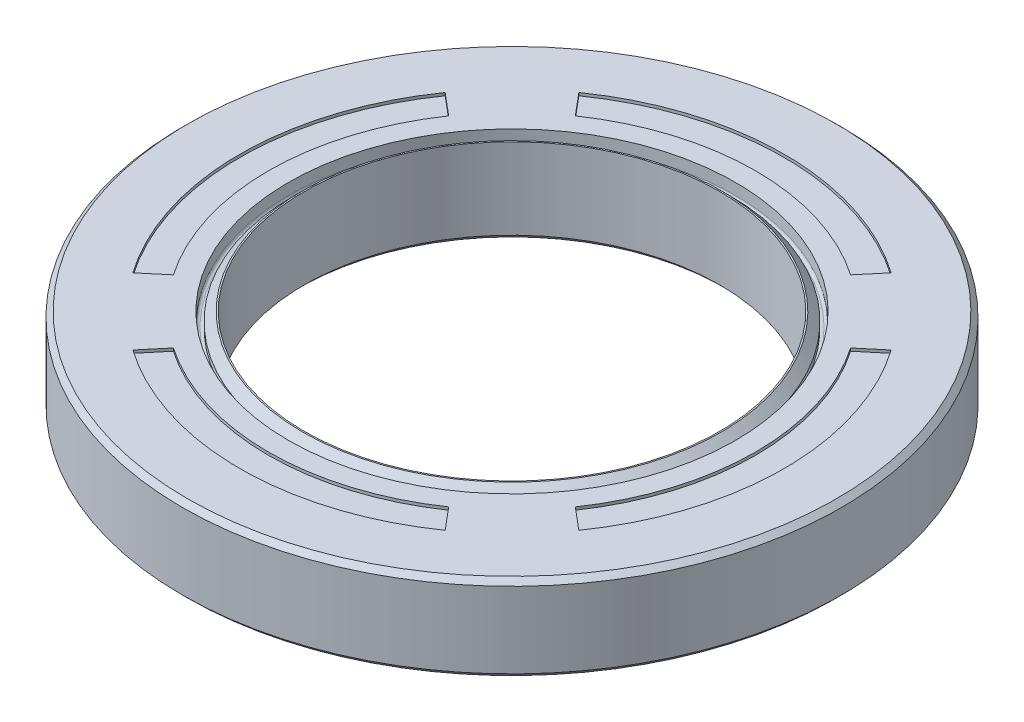
ISO-10303-21;
HEADER;
FILE_DESCRIPTION(('STEP AP214'),'2;1');
FILE_NAME('part.step','',(''),(''),'','','');
FILE_SCHEMA(('AUTOMOTIVE_DESIGN { 1 0 10303 214 1 1 1 1 }'));
ENDSEC;
DATA;
#1=APPLICATION_CONTEXT('core data for automotive mechanical design processes');
#2=APPLICATION_PROTOCOL_DEFINITION('international standard','automotive_design',2000,#1);
#3=PRODUCT_CONTEXT('',#1,'mechanical');
#4=PRODUCT('Part','Part','',(#3));
#5=PRODUCT_RELATED_PRODUCT_CATEGORY('part','',(#4));
#6=PRODUCT_DEFINITION_FORMATION('','',#4);
#7=PRODUCT_DEFINITION_CONTEXT('part definition',#1,'design');
#8=PRODUCT_DEFINITION('design','',#6,#7);
#9=PRODUCT_DEFINITION_SHAPE('','',#8);
#10=(LENGTH_UNIT() NAMED_UNIT(*) SI_UNIT(.MILLI.,.METRE.));
#11=(NAMED_UNIT(*) PLANE_ANGLE_UNIT() SI_UNIT($,.RADIAN.));
#12=(NAMED_UNIT(*) SI_UNIT($,.STERADIAN.) SOLID_ANGLE_UNIT());
#13=UNCERTAINTY_MEASURE_WITH_UNIT(LENGTH_MEASURE(1.E-05),#10,'distance_accuracy_value','');
#14=(GEOMETRIC_REPRESENTATION_CONTEXT(3) GLOBAL_UNCERTAINTY_ASSIGNED_CONTEXT((#13)) GLOBAL_UNIT_ASSIGNED_CONTEXT((#10,
#11,#12)) REPRESENTATION_CONTEXT('',''));
#15=CARTESIAN_POINT('',(0.,0.,0.));
#16=DIRECTION('',(0.,0.,1.));
#17=DIRECTION('',(1.,0.,0.));
#18=AXIS2_PLACEMENT_3D('',#15,#16,#17);
#19=CARTESIAN_POINT('',(0.,3.44120691776485,0.));
#20=DIRECTION('',(0.,1.,0.));
#21=DIRECTION('',(0.,0.,1.));
#22=AXIS2_PLACEMENT_3D('',#19,#20,#21);
#23=TOROIDAL_SURFACE('',#22,15.4,0.2);
#24=CARTESIAN_POINT('',(0.,3.44120691776485,0.));
#25=DIRECTION('',(0.,1.,0.));
#26=DIRECTION('',(0.,0.,1.));
#27=AXIS2_PLACEMENT_3D('',#24,#25,#26);
#28=CIRCLE('',#27,15.6);
#29=CARTESIAN_POINT('',(0.,3.44120691776485,15.6));
#30=VERTEX_POINT('',#29);
#31=EDGE_CURVE('E275',#30,#30,#28,.T.);
#32=ORIENTED_EDGE('',*,*,#31,.T.);
#33=EDGE_LOOP('',(#32));
#34=FACE_BOUND('',#33,.T.);
#35=CARTESIAN_POINT('',(0.,3.24120691776485,0.));
#36=DIRECTION('',(0.,1.,0.));
#37=DIRECTION('',(0.,0.,1.));
#38=AXIS2_PLACEMENT_3D('',#35,#36,#37);
#39=CIRCLE('',#38,15.4);
#40=CARTESIAN_POINT('',(0.,3.24120691776485,15.4));
#41=VERTEX_POINT('',#40);
#42=EDGE_CURVE('E11',#41,#41,#39,.T.);
#43=ORIENTED_EDGE('',*,*,#42,.F.);
#44=EDGE_LOOP('',(#43));
#45=FACE_BOUND('',#44,.T.);
#46=ADVANCED_FACE('F37',(#34,#45),#23,.F.);
#47=CARTESIAN_POINT('',(0.,3.24120691776485,0.));
#48=DIRECTION('',(0.,1.,0.));
#49=DIRECTION('',(0.,0.,1.));
#50=AXIS2_PLACEMENT_3D('',#47,#48,#49);
#51=PLANE('',#50);
#52=ORIENTED_EDGE('',*,*,#42,.T.);
#53=EDGE_LOOP('',(#52));
#54=FACE_BOUND('',#53,.T.);
#55=CARTESIAN_POINT('',(0.,3.24120691776485,0.));
#56=DIRECTION('',(0.,1.,0.));
#57=DIRECTION('',(0.,0.,1.));
#58=AXIS2_PLACEMENT_3D('',#55,#56,#57);
#59=CIRCLE('',#58,15.2);
#60=CARTESIAN_POINT('',(0.,3.24120691776485,15.2));
#61=VERTEX_POINT('',#60);
#62=EDGE_CURVE('E44',#61,#61,#59,.T.);
#63=ORIENTED_EDGE('',*,*,#62,.F.);
#64=EDGE_LOOP('',(#63));
#65=FACE_BOUND('',#64,.T.);
#66=ADVANCED_FACE('F331',(#54,#65),#51,.T.);
#67=CARTESIAN_POINT('',(0.,10.7720965877437,0.));
#68=DIRECTION('',(0.,1.,0.));
#69=DIRECTION('',(0.,0.,1.));
#70=AXIS2_PLACEMENT_3D('',#67,#68,#69);
#71=CYLINDRICAL_SURFACE('',#70,15.2);
#72=ORIENTED_EDGE('',*,*,#62,.T.);
#73=EDGE_LOOP('',(#72));
#74=FACE_BOUND('',#73,.T.);
#75=CARTESIAN_POINT('',(0.,3.64120691776485,0.));
#76=DIRECTION('',(0.,1.,0.));
#77=DIRECTION('',(0.,0.,1.));
#78=AXIS2_PLACEMENT_3D('',#75,#76,#77);
#79=CIRCLE('',#78,15.2);
#80=CARTESIAN_POINT('',(0.,3.64120691776485,15.2));
#81=VERTEX_POINT('',#80);
#82=EDGE_CURVE('E323',#81,#81,#79,.T.);
#83=ORIENTED_EDGE('',*,*,#82,.F.);
#84=EDGE_LOOP('',(#83));
#85=FACE_BOUND('',#84,.T.);
#86=ADVANCED_FACE('F328',(#74,#85),#71,.T.);
#87=CARTESIAN_POINT('',(0.,4.24120691776485,0.));
#88=DIRECTION('',(0.,-1.,0.));
#89=DIRECTION('',(0.,0.,-1.));
#90=AXIS2_PLACEMENT_3D('',#87,#88,#89);
#91=CONICAL_SURFACE('',#90,14.6,0.785398163397452);
#92=ORIENTED_EDGE('',*,*,#82,.T.);
#93=EDGE_LOOP('',(#92));
#94=FACE_BOUND('',#93,.T.);
#95=CARTESIAN_POINT('',(0.,4.24120691776485,0.));
#96=DIRECTION('',(0.,1.,0.));
#97=DIRECTION('',(0.,0.,1.));
#98=AXIS2_PLACEMENT_3D('',#95,#96,#97);
#99=CIRCLE('',#98,14.6);
#100=CARTESIAN_POINT('',(0.,4.24120691776485,14.6));
#101=VERTEX_POINT('',#100);
#102=EDGE_CURVE('E320',#101,#101,#99,.T.);
#103=ORIENTED_EDGE('',*,*,#102,.F.);
#104=EDGE_LOOP('',(#103));
#105=FACE_BOUND('',#104,.T.);
#106=ADVANCED_FACE('F338',(#94,#105),#91,.T.);
#107=CARTESIAN_POINT('',(1.47146424134457E-13,4.24120691776485,0.));
#108=DIRECTION('',(0.,1.,0.));
#109=DIRECTION('',(0.,0.,1.));
#110=AXIS2_PLACEMENT_3D('',#107,#108,#109);
#111=PLANE('',#110);
#112=ORIENTED_EDGE('',*,*,#102,.T.);
#113=EDGE_LOOP('',(#112));
#114=FACE_BOUND('',#113,.T.);
#115=CARTESIAN_POINT('',(0.,4.24120691776485,0.));
#116=DIRECTION('',(0.,1.,0.));
#117=DIRECTION('',(0.,0.,1.));
#118=AXIS2_PLACEMENT_3D('',#115,#116,#117);
#119=CIRCLE('',#118,14.5);
#120=CARTESIAN_POINT('',(0.,4.24120691776485,14.5));
#121=VERTEX_POINT('',#120);
#122=EDGE_CURVE('E317',#121,#121,#119,.T.);
#123=ORIENTED_EDGE('',*,*,#122,.F.);
#124=EDGE_LOOP('',(#123));
#125=FACE_BOUND('',#124,.T.);
#126=ADVANCED_FACE('F344',(#114,#125),#111,.T.);
#127=CARTESIAN_POINT('',(0.,10.7720965877437,0.));
#128=DIRECTION('',(0.,1.,0.));
#129=DIRECTION('',(0.,0.,1.));
#130=AXIS2_PLACEMENT_3D('',#127,#128,#129);
#131=CYLINDRICAL_SURFACE('',#130,14.5);
#132=ORIENTED_EDGE('',*,*,#122,.T.);
#133=EDGE_LOOP('',(#132));
#134=FACE_BOUND('',#133,.T.);
#135=CARTESIAN_POINT('',(0.,-1.40523969164188,0.));
#136=DIRECTION('',(0.,1.,0.));
#137=DIRECTION('',(0.,0.,1.));
#138=AXIS2_PLACEMENT_3D('',#135,#136,#137);
#139=CIRCLE('',#138,14.5);
#140=CARTESIAN_POINT('',(0.,-1.40523969164188,14.5));
#141=VERTEX_POINT('',#140);
#142=EDGE_CURVE('E314',#141,#141,#139,.T.);
#143=ORIENTED_EDGE('',*,*,#142,.F.);
#144=EDGE_LOOP('',(#143));
#145=FACE_BOUND('',#144,.T.);
#146=ADVANCED_FACE('F348',(#134,#145),#131,.F.);
#147=CARTESIAN_POINT('',(0.,-1.40523969164188,0.));
#148=DIRECTION('',(0.,-1.,0.));
#149=DIRECTION('',(0.,0.,-1.));
#150=AXIS2_PLACEMENT_3D('',#147,#148,#149);
#151=CONICAL_SURFACE('',#150,14.5,0.785398163397446);
#152=CARTESIAN_POINT('',(0.,-1.75879308223515,0.));
#153=DIRECTION('',(0.,1.,0.));
#154=DIRECTION('',(0.,0.,1.));
#155=AXIS2_PLACEMENT_3D('',#152,#153,#154);
#156=CIRCLE('',#155,14.8535533905933);
#157=CARTESIAN_POINT('',(0.,-1.75879308223515,14.8535533905933));
#158=VERTEX_POINT('',#157);
#159=EDGE_CURVE('E311',#158,#158,#156,.T.);
#160=ORIENTED_EDGE('',*,*,#159,.F.);
#161=EDGE_LOOP('',(#160));
#162=FACE_BOUND('',#161,.T.);
#163=ORIENTED_EDGE('',*,*,#142,.T.);
#164=EDGE_LOOP('',(#163));
#165=FACE_BOUND('',#164,.T.);
#166=ADVANCED_FACE('F352',(#162,#165),#151,.F.);
#167=CARTESIAN_POINT('',(0.,-1.75879308223515,0.));
#168=DIRECTION('',(0.,1.,0.));
#169=DIRECTION('',(0.,0.,1.));
#170=AXIS2_PLACEMENT_3D('',#167,#168,#169);
#171=PLANE('',#170);
#172=CARTESIAN_POINT('',(0.,-1.75879308223515,0.));
#173=DIRECTION('',(0.,1.,0.));
#174=DIRECTION('',(0.,0.,1.));
#175=AXIS2_PLACEMENT_3D('',#172,#173,#174);
#176=CIRCLE('',#175,17.5);
#177=CARTESIAN_POINT('',(0.,-1.75879308223515,17.5));
#178=VERTEX_POINT('',#177);
#179=EDGE_CURVE('E308',#178,#178,#176,.T.);
#180=ORIENTED_EDGE('',*,*,#179,.F.);
#181=EDGE_LOOP('',(#180));
#182=FACE_BOUND('',#181,.T.);
#183=ORIENTED_EDGE('',*,*,#159,.T.);
#184=EDGE_LOOP('',(#183));
#185=FACE_BOUND('',#184,.T.);
#186=ADVANCED_FACE('F356',(#182,#185),#171,.F.);
#187=CARTESIAN_POINT('',(0.,10.7720965877437,0.));
#188=DIRECTION('',(0.,1.,0.));
#189=DIRECTION('',(0.,0.,1.));
#190=AXIS2_PLACEMENT_3D('',#187,#188,#189);
#191=CYLINDRICAL_SURFACE('',#190,17.5);
#192=CARTESIAN_POINT('',(0.,2.54120691776485,0.));
#193=DIRECTION('',(0.,1.,0.));
#194=DIRECTION('',(0.,0.,1.));
#195=AXIS2_PLACEMENT_3D('',#192,#193,#194);
#196=CIRCLE('',#195,17.5);
#197=CARTESIAN_POINT('',(0.,2.54120691776485,17.5));
#198=VERTEX_POINT('',#197);
#199=EDGE_CURVE('E305',#198,#198,#196,.T.);
#200=ORIENTED_EDGE('',*,*,#199,.F.);
#201=EDGE_LOOP('',(#200));
#202=FACE_BOUND('',#201,.T.);
#203=ORIENTED_EDGE('',*,*,#179,.T.);
#204=EDGE_LOOP('',(#203));
#205=FACE_BOUND('',#204,.T.);
#206=ADVANCED_FACE('F360',(#202,#205),#191,.T.);
#207=CARTESIAN_POINT('',(0.,2.54120691776485,0.));
#208=DIRECTION('',(0.,1.,0.));
#209=DIRECTION('',(0.,0.,1.));
#210=AXIS2_PLACEMENT_3D('',#207,#208,#209);
#211=PLANE('',#210);
#212=CARTESIAN_POINT('',(0.,2.54120691776485,0.));
#213=DIRECTION('',(0.,1.,0.));
#214=DIRECTION('',(0.,0.,1.));
#215=AXIS2_PLACEMENT_3D('',#212,#213,#214);
#216=CIRCLE('',#215,21.);
#217=CARTESIAN_POINT('',(0.,2.54120691776485,21.));
#218=VERTEX_POINT('',#217);
#219=EDGE_CURVE('E302',#218,#218,#216,.T.);
#220=ORIENTED_EDGE('',*,*,#219,.F.);
#221=EDGE_LOOP('',(#220));
#222=FACE_BOUND('',#221,.T.);
#223=ORIENTED_EDGE('',*,*,#199,.T.);
#224=EDGE_LOOP('',(#223));
#225=FACE_BOUND('',#224,.T.);
#226=ADVANCED_FACE('F364',(#222,#225),#211,.F.);
#227=CARTESIAN_POINT('',(0.,10.7720965877437,0.));
#228=DIRECTION('',(0.,1.,0.));
#229=DIRECTION('',(0.,0.,1.));
#230=AXIS2_PLACEMENT_3D('',#227,#228,#229);
#231=CYLINDRICAL_SURFACE('',#230,21.);
#232=CARTESIAN_POINT('',(0.,-1.75879308223515,0.));
#233=DIRECTION('',(0.,1.,0.));
#234=DIRECTION('',(0.,0.,1.));
#235=AXIS2_PLACEMENT_3D('',#232,#233,#234);
#236=CIRCLE('',#235,21.);
#237=CARTESIAN_POINT('',(0.,-1.75879308223515,21.));
#238=VERTEX_POINT('',#237);
#239=EDGE_CURVE('E299',#238,#238,#236,.T.);
#240=ORIENTED_EDGE('',*,*,#239,.F.);
#241=EDGE_LOOP('',(#240));
#242=FACE_BOUND('',#241,.T.);
#243=ORIENTED_EDGE('',*,*,#219,.T.);
#244=EDGE_LOOP('',(#243));
#245=FACE_BOUND('',#244,.T.);
#246=ADVANCED_FACE('F368',(#242,#245),#231,.F.);
#247=CARTESIAN_POINT('',(0.,-1.75879308223515,0.));
#248=DIRECTION('',(0.,1.,0.));
#249=DIRECTION('',(0.,0.,1.));
#250=AXIS2_PLACEMENT_3D('',#247,#248,#249);
#251=PLANE('',#250);
#252=CARTESIAN_POINT('',(0.,-1.75879308223515,0.));
#253=DIRECTION('',(0.,1.,0.));
#254=DIRECTION('',(0.,0.,1.));
#255=AXIS2_PLACEMENT_3D('',#252,#253,#254);
#256=CIRCLE('',#255,22.6464466094067);
#257=CARTESIAN_POINT('',(0.,-1.75879308223515,22.6464466094067));
#258=VERTEX_POINT('',#257);
#259=EDGE_CURVE('E296',#258,#258,#256,.T.);
#260=ORIENTED_EDGE('',*,*,#259,.F.);
#261=EDGE_LOOP('',(#260));
#262=FACE_BOUND('',#261,.T.);
#263=ORIENTED_EDGE('',*,*,#239,.T.);
#264=EDGE_LOOP('',(#263));
#265=FACE_BOUND('',#264,.T.);
#266=ADVANCED_FACE('F372',(#262,#265),#251,.F.);
#267=CARTESIAN_POINT('',(0.,-1.40523969164188,0.));
#268=DIRECTION('',(0.,1.,0.));
#269=DIRECTION('',(0.,0.,1.));
#270=AXIS2_PLACEMENT_3D('',#267,#268,#269);
#271=CONICAL_SURFACE('',#270,23.,0.785398163397461);
#272=ORIENTED_EDGE('',*,*,#259,.T.);
#273=EDGE_LOOP('',(#272));
#274=FACE_BOUND('',#273,.T.);
#275=CARTESIAN_POINT('',(0.,-1.40523969164188,0.));
#276=DIRECTION('',(0.,1.,0.));
#277=DIRECTION('',(0.,0.,1.));
#278=AXIS2_PLACEMENT_3D('',#275,#276,#277);
#279=CIRCLE('',#278,23.);
#280=CARTESIAN_POINT('',(0.,-1.40523969164188,23.));
#281=VERTEX_POINT('',#280);
#282=EDGE_CURVE('E293',#281,#281,#279,.T.);
#283=ORIENTED_EDGE('',*,*,#282,.F.);
#284=EDGE_LOOP('',(#283));
#285=FACE_BOUND('',#284,.T.);
#286=ADVANCED_FACE('F376',(#274,#285),#271,.T.);
#287=CARTESIAN_POINT('',(0.,10.7720965877437,0.));
#288=DIRECTION('',(0.,1.,0.));
#289=DIRECTION('',(0.,0.,1.));
#290=AXIS2_PLACEMENT_3D('',#287,#288,#289);
#291=CYLINDRICAL_SURFACE('',#290,23.);
#292=ORIENTED_EDGE('',*,*,#282,.T.);
#293=EDGE_LOOP('',(#292));
#294=FACE_BOUND('',#293,.T.);
#295=CARTESIAN_POINT('',(0.,3.88765352717158,0.));
#296=DIRECTION('',(0.,1.,0.));
#297=DIRECTION('',(0.,0.,1.));
#298=AXIS2_PLACEMENT_3D('',#295,#296,#297);
#299=CIRCLE('',#298,23.);
#300=CARTESIAN_POINT('',(0.,3.88765352717158,23.));
#301=VERTEX_POINT('',#300);
#302=EDGE_CURVE('E290',#301,#301,#299,.T.);
#303=ORIENTED_EDGE('',*,*,#302,.F.);
#304=EDGE_LOOP('',(#303));
#305=FACE_BOUND('',#304,.T.);
#306=ADVANCED_FACE('F380',(#294,#305),#291,.T.);
#307=CARTESIAN_POINT('',(0.,4.24120691776485,0.));
#308=DIRECTION('',(0.,-1.,0.));
#309=DIRECTION('',(0.,0.,-1.));
#310=AXIS2_PLACEMENT_3D('',#307,#308,#309);
#311=CONICAL_SURFACE('',#310,22.6464466094067,0.785398163397448);
#312=ORIENTED_EDGE('',*,*,#302,.T.);
#313=EDGE_LOOP('',(#312));
#314=FACE_BOUND('',#313,.T.);
#315=CARTESIAN_POINT('',(0.,4.24120691776485,0.));
#316=DIRECTION('',(0.,1.,0.));
#317=DIRECTION('',(0.,0.,1.));
#318=AXIS2_PLACEMENT_3D('',#315,#316,#317);
#319=CIRCLE('',#318,22.6464466094067);
#320=CARTESIAN_POINT('',(0.,4.24120691776485,22.6464466094067));
#321=VERTEX_POINT('',#320);
#322=EDGE_CURVE('E287',#321,#321,#319,.T.);
#323=ORIENTED_EDGE('',*,*,#322,.F.);
#324=EDGE_LOOP('',(#323));
#325=FACE_BOUND('',#324,.T.);
#326=ADVANCED_FACE('F384',(#314,#325),#311,.T.);
#327=CARTESIAN_POINT('',(0.,4.24120691776485,0.));
#328=DIRECTION('',(0.,1.,0.));
#329=DIRECTION('',(0.,0.,1.));
#330=AXIS2_PLACEMENT_3D('',#327,#328,#329);
#331=PLANE('',#330);
#332=CARTESIAN_POINT('',(0.,4.24120691776485,0.));
#333=DIRECTION('',(0.,1.,0.));
#334=DIRECTION('',(1.,0.,0.));
#335=AXIS2_PLACEMENT_3D('',#332,#333,#334);
#336=CIRCLE('',#335,19.);
#337=CARTESIAN_POINT('',(-10.8979522906698,4.24120691776485,15.5638888414909));
#338=VERTEX_POINT('',#337);
#339=CARTESIAN_POINT('',(10.8979522906699,4.24120691776485,15.5638888414908));
#340=VERTEX_POINT('',#339);
#341=EDGE_CURVE('E51',#338,#340,#336,.T.);
#342=ORIENTED_EDGE('',*,*,#341,.F.);
#343=DIRECTION('',(-0.642787609686539,0.,0.766044443118979));
#344=VECTOR('',#343,1.);
#345=CARTESIAN_POINT('',(-9.60688480104458,4.24120691776485,14.0252545224484));
#346=LINE('',#345,#344);
#347=CARTESIAN_POINT('',(-9.60688480104457,4.24120691776485,14.0252545224484));
#348=VERTEX_POINT('',#347);
#349=EDGE_CURVE('E169',#348,#338,#346,.T.);
#350=ORIENTED_EDGE('',*,*,#349,.F.);
#351=CARTESIAN_POINT('',(0.,4.24120691776485,0.));
#352=DIRECTION('',(0.,-1.,0.));
#353=DIRECTION('',(1.,0.,0.));
#354=AXIS2_PLACEMENT_3D('',#351,#352,#353);
#355=CIRCLE('',#354,17.);
#356=CARTESIAN_POINT('',(9.60688480104469,4.24120691776485,14.0252545224483));
#357=VERTEX_POINT('',#356);
#358=EDGE_CURVE('E172',#357,#348,#355,.T.);
#359=ORIENTED_EDGE('',*,*,#358,.F.);
#360=DIRECTION('',(-0.642787609686543,0.,-0.766044443118975));
#361=VECTOR('',#360,1.);
#362=CARTESIAN_POINT('',(9.60688480104469,4.24120691776485,14.0252545224483));
#363=LINE('',#362,#361);
#364=EDGE_CURVE('E178',#340,#357,#363,.T.);
#365=ORIENTED_EDGE('',*,*,#364,.F.);
#366=EDGE_LOOP('',(#342,#350,#359,#365));
#367=FACE_BOUND('',#366,.T.);
#368=CARTESIAN_POINT('',(0.,4.24120691776485,0.));
#369=DIRECTION('',(0.,1.,0.));
#370=DIRECTION('',(0.,0.,-1.));
#371=AXIS2_PLACEMENT_3D('',#368,#369,#370);
#372=CIRCLE('',#371,19.);
#373=CARTESIAN_POINT('',(15.5638888414908,4.24120691776485,10.8979522906699));
#374=VERTEX_POINT('',#373);
#375=CARTESIAN_POINT('',(15.5638888414908,4.24120691776485,-10.8979522906699));
#376=VERTEX_POINT('',#375);
#377=EDGE_CURVE('E59',#374,#376,#372,.T.);
#378=ORIENTED_EDGE('',*,*,#377,.F.);
#379=DIRECTION('',(0.766044443118976,0.,0.642787609686542));
#380=VECTOR('',#379,1.);
#381=CARTESIAN_POINT('',(14.0252545224483,4.24120691776485,9.60688480104462));
#382=LINE('',#381,#380);
#383=CARTESIAN_POINT('',(14.0252545224483,4.24120691776485,9.60688480104462));
#384=VERTEX_POINT('',#383);
#385=EDGE_CURVE('E193',#384,#374,#382,.T.);
#386=ORIENTED_EDGE('',*,*,#385,.F.);
#387=CARTESIAN_POINT('',(0.,4.24120691776485,0.));
#388=DIRECTION('',(0.,-1.,0.));
#389=DIRECTION('',(0.,0.,-1.));
#390=AXIS2_PLACEMENT_3D('',#387,#388,#389);
#391=CIRCLE('',#390,17.);
#392=CARTESIAN_POINT('',(14.0252545224483,4.24120691776485,-9.60688480104464));
#393=VERTEX_POINT('',#392);
#394=EDGE_CURVE('E208',#393,#384,#391,.T.);
#395=ORIENTED_EDGE('',*,*,#394,.F.);
#396=DIRECTION('',(-0.766044443118977,0.,0.64278760968654));
#397=VECTOR('',#396,1.);
#398=CARTESIAN_POINT('',(14.0252545224483,4.24120691776485,-9.60688480104464));
#399=LINE('',#398,#397);
#400=EDGE_CURVE('E204',#376,#393,#399,.T.);
#401=ORIENTED_EDGE('',*,*,#400,.F.);
#402=EDGE_LOOP('',(#378,#386,#395,#401));
#403=FACE_BOUND('',#402,.T.);
#404=CARTESIAN_POINT('',(0.,4.24120691776485,0.));
#405=DIRECTION('',(0.,1.,0.));
#406=DIRECTION('',(-1.,0.,0.));
#407=AXIS2_PLACEMENT_3D('',#404,#405,#406);
#408=CIRCLE('',#407,19.);
#409=CARTESIAN_POINT('',(10.8979522906697,4.24120691776485,-15.563888841491));
#410=VERTEX_POINT('',#409);
#411=CARTESIAN_POINT('',(-10.8979522906701,4.24120691776485,-15.5638888414907));
#412=VERTEX_POINT('',#411);
#413=EDGE_CURVE('E233',#410,#412,#408,.T.);
#414=ORIENTED_EDGE('',*,*,#413,.F.);
#415=DIRECTION('',(0.642787609686534,0.,-0.766044443118983));
#416=VECTOR('',#415,1.);
#417=CARTESIAN_POINT('',(9.60688480104448,4.24120691776485,-14.0252545224484));
#418=LINE('',#417,#416);
#419=CARTESIAN_POINT('',(9.60688480104447,4.24120691776485,-14.0252545224484));
#420=VERTEX_POINT('',#419);
#421=EDGE_CURVE('E223',#420,#410,#418,.T.);
#422=ORIENTED_EDGE('',*,*,#421,.F.);
#423=CARTESIAN_POINT('',(0.,4.24120691776485,0.));
#424=DIRECTION('',(0.,-1.,0.));
#425=DIRECTION('',(-1.,0.,0.));
#426=AXIS2_PLACEMENT_3D('',#423,#424,#425);
#427=CIRCLE('',#426,17.);
#428=CARTESIAN_POINT('',(-9.60688480104478,4.24120691776485,-14.0252545224482));
#429=VERTEX_POINT('',#428);
#430=EDGE_CURVE('E238',#429,#420,#427,.T.);
#431=ORIENTED_EDGE('',*,*,#430,.F.);
#432=DIRECTION('',(0.642787609686548,0.,0.76604444311897));
#433=VECTOR('',#432,1.);
#434=CARTESIAN_POINT('',(-9.60688480104478,4.24120691776485,-14.0252545224482));
#435=LINE('',#434,#433);
#436=EDGE_CURVE('E235',#412,#429,#435,.T.);
#437=ORIENTED_EDGE('',*,*,#436,.F.);
#438=EDGE_LOOP('',(#414,#422,#431,#437));
#439=FACE_BOUND('',#438,.T.);
#440=CARTESIAN_POINT('',(0.,4.24120691776485,0.));
#441=DIRECTION('',(0.,1.,0.));
#442=DIRECTION('',(0.,0.,1.));
#443=AXIS2_PLACEMENT_3D('',#440,#441,#442);
#444=CIRCLE('',#443,19.);
#445=CARTESIAN_POINT('',(-15.5638888414908,4.24120691776485,-10.8979522906699));
#446=VERTEX_POINT('',#445);
#447=CARTESIAN_POINT('',(-15.5638888414908,4.24120691776485,10.8979522906699));
#448=VERTEX_POINT('',#447);
#449=EDGE_CURVE('E185',#446,#448,#444,.T.);
#450=ORIENTED_EDGE('',*,*,#449,.F.);
#451=DIRECTION('',(-0.766044443118976,0.,-0.642787609686542));
#452=VECTOR('',#451,1.);
#453=CARTESIAN_POINT('',(-14.0252545224483,4.24120691776485,-9.60688480104462));
#454=LINE('',#453,#452);
#455=CARTESIAN_POINT('',(-14.0252545224483,4.24120691776485,-9.60688480104462));
#456=VERTEX_POINT('',#455);
#457=EDGE_CURVE('E254',#456,#446,#454,.T.);
#458=ORIENTED_EDGE('',*,*,#457,.F.);
#459=CARTESIAN_POINT('',(0.,4.24120691776485,0.));
#460=DIRECTION('',(0.,-1.,0.));
#461=DIRECTION('',(0.,0.,1.));
#462=AXIS2_PLACEMENT_3D('',#459,#460,#461);
#463=CIRCLE('',#462,17.);
#464=CARTESIAN_POINT('',(-14.0252545224483,4.24120691776485,9.60688480104464));
#465=VERTEX_POINT('',#464);
#466=EDGE_CURVE('E268',#465,#456,#463,.T.);
#467=ORIENTED_EDGE('',*,*,#466,.F.);
#468=DIRECTION('',(0.766044443118977,0.,-0.64278760968654));
#469=VECTOR('',#468,1.);
#470=CARTESIAN_POINT('',(-14.0252545224483,4.24120691776485,9.60688480104464));
#471=LINE('',#470,#469);
#472=EDGE_CURVE('E265',#448,#465,#471,.T.);
#473=ORIENTED_EDGE('',*,*,#472,.F.);
#474=EDGE_LOOP('',(#450,#458,#467,#473));
#475=FACE_BOUND('',#474,.T.);
#476=ORIENTED_EDGE('',*,*,#322,.T.);
#477=EDGE_LOOP('',(#476));
#478=FACE_BOUND('',#477,.T.);
#479=CARTESIAN_POINT('',(0.,4.24120691776485,0.));
#480=DIRECTION('',(0.,1.,0.));
#481=DIRECTION('',(0.,0.,1.));
#482=AXIS2_PLACEMENT_3D('',#479,#480,#481);
#483=CIRCLE('',#482,15.6);
#484=CARTESIAN_POINT('',(0.,4.24120691776485,15.6));
#485=VERTEX_POINT('',#484);
#486=EDGE_CURVE('E284',#485,#485,#483,.T.);
#487=ORIENTED_EDGE('',*,*,#486,.F.);
#488=EDGE_LOOP('',(#487));
#489=FACE_BOUND('',#488,.T.);
#490=ADVANCED_FACE('F388',(#367,#403,#439,#475,#478,#489),#331,.T.);
#491=CARTESIAN_POINT('',(0.,10.7720965877437,0.));
#492=DIRECTION('',(0.,1.,0.));
#493=DIRECTION('',(0.,0.,1.));
#494=AXIS2_PLACEMENT_3D('',#491,#492,#493);
#495=CYLINDRICAL_SURFACE('',#494,15.6);
#496=ORIENTED_EDGE('',*,*,#486,.T.);
#497=EDGE_LOOP('',(#496));
#498=FACE_BOUND('',#497,.T.);
#499=ORIENTED_EDGE('',*,*,#31,.F.);
#500=EDGE_LOOP('',(#499));
#501=FACE_BOUND('',#500,.T.);
#502=ADVANCED_FACE('F392',(#498,#501),#495,.F.);
#503=CARTESIAN_POINT('',(0.,4.04120691776485,0.));
#504=DIRECTION('',(0.,1.,0.));
#505=DIRECTION('',(0.,0.,1.));
#506=AXIS2_PLACEMENT_3D('',#503,#504,#505);
#507=CYLINDRICAL_SURFACE('',#506,19.);
#508=ORIENTED_EDGE('',*,*,#449,.T.);
#509=DIRECTION('',(0.,1.,0.));
#510=VECTOR('',#509,1.);
#511=CARTESIAN_POINT('',(-15.5638888414908,4.04120691776485,10.8979522906699));
#512=LINE('',#511,#510);
#513=CARTESIAN_POINT('',(-15.5638888414908,4.04120691776485,10.8979522906699));
#514=VERTEX_POINT('',#513);
#515=EDGE_CURVE('E263',#514,#448,#512,.T.);
#516=ORIENTED_EDGE('',*,*,#515,.F.);
#517=CARTESIAN_POINT('',(0.,4.04120691776485,0.));
#518=DIRECTION('',(0.,1.,0.));
#519=DIRECTION('',(0.,0.,1.));
#520=AXIS2_PLACEMENT_3D('',#517,#518,#519);
#521=CIRCLE('',#520,19.);
#522=CARTESIAN_POINT('',(-15.5638888414908,4.04120691776485,-10.8979522906699));
#523=VERTEX_POINT('',#522);
#524=EDGE_CURVE('E250',#523,#514,#521,.T.);
#525=ORIENTED_EDGE('',*,*,#524,.F.);
#526=DIRECTION('',(0.,1.,0.));
#527=VECTOR('',#526,1.);
#528=CARTESIAN_POINT('',(-15.5638888414908,4.04120691776485,-10.8979522906699));
#529=LINE('',#528,#527);
#530=EDGE_CURVE('E273',#523,#446,#529,.T.);
#531=ORIENTED_EDGE('',*,*,#530,.T.);
#532=EDGE_LOOP('',(#508,#516,#525,#531));
#533=FACE_BOUND('',#532,.T.);
#534=ADVANCED_FACE('F396',(#533),#507,.F.);
#535=CARTESIAN_POINT('',(-14.0252545224483,4.04120691776485,-9.60688480104462));
#536=DIRECTION('',(0.642787609686541,0.,-0.766044443118976));
#537=DIRECTION('',(-0.766044443118976,0.,-0.642787609686541));
#538=AXIS2_PLACEMENT_3D('',#535,#536,#537);
#539=PLANE('',#538);
#540=ORIENTED_EDGE('',*,*,#457,.T.);
#541=ORIENTED_EDGE('',*,*,#530,.F.);
#542=DIRECTION('',(-0.766044443118976,0.,-0.642787609686542));
#543=VECTOR('',#542,1.);
#544=CARTESIAN_POINT('',(-14.0252545224483,4.04120691776485,-9.60688480104462));
#545=LINE('',#544,#543);
#546=CARTESIAN_POINT('',(-14.0252545224483,4.04120691776485,-9.60688480104462));
#547=VERTEX_POINT('',#546);
#548=EDGE_CURVE('E260',#547,#523,#545,.T.);
#549=ORIENTED_EDGE('',*,*,#548,.F.);
#550=DIRECTION('',(0.,1.,0.));
#551=VECTOR('',#550,1.);
#552=CARTESIAN_POINT('',(-14.0252545224483,4.04120691776485,-9.60688480104462));
#553=LINE('',#552,#551);
#554=EDGE_CURVE('E276',#547,#456,#553,.T.);
#555=ORIENTED_EDGE('',*,*,#554,.T.);
#556=EDGE_LOOP('',(#540,#541,#549,#555));
#557=FACE_BOUND('',#556,.T.);
#558=ADVANCED_FACE('F400',(#557),#539,.F.);
#559=CARTESIAN_POINT('',(0.,4.04120691776485,0.));
#560=DIRECTION('',(0.,1.,0.));
#561=DIRECTION('',(0.,0.,1.));
#562=AXIS2_PLACEMENT_3D('',#559,#560,#561);
#563=CYLINDRICAL_SURFACE('',#562,17.);
#564=ORIENTED_EDGE('',*,*,#466,.T.);
#565=ORIENTED_EDGE('',*,*,#554,.F.);
#566=CARTESIAN_POINT('',(0.,4.04120691776485,0.));
#567=DIRECTION('',(0.,-1.,0.));
#568=DIRECTION('',(0.,0.,1.));
#569=AXIS2_PLACEMENT_3D('',#566,#567,#568);
#570=CIRCLE('',#569,17.);
#571=CARTESIAN_POINT('',(-14.0252545224483,4.04120691776485,9.60688480104464));
#572=VERTEX_POINT('',#571);
#573=EDGE_CURVE('E257',#572,#547,#570,.T.);
#574=ORIENTED_EDGE('',*,*,#573,.F.);
#575=DIRECTION('',(0.,1.,0.));
#576=VECTOR('',#575,1.);
#577=CARTESIAN_POINT('',(-14.0252545224483,4.04120691776485,9.60688480104464));
#578=LINE('',#577,#576);
#579=EDGE_CURVE('E278',#572,#465,#578,.T.);
#580=ORIENTED_EDGE('',*,*,#579,.T.);
#581=EDGE_LOOP('',(#564,#565,#574,#580));
#582=FACE_BOUND('',#581,.T.);
#583=ADVANCED_FACE('F406',(#582),#563,.T.);
#584=CARTESIAN_POINT('',(-14.0252545224483,4.04120691776485,9.60688480104464));
#585=DIRECTION('',(0.642787609686541,0.,0.766044443118977));
#586=DIRECTION('',(0.766044443118977,0.,-0.642787609686541));
#587=AXIS2_PLACEMENT_3D('',#584,#585,#586);
#588=PLANE('',#587);
#589=ORIENTED_EDGE('',*,*,#472,.T.);
#590=ORIENTED_EDGE('',*,*,#579,.F.);
#591=DIRECTION('',(0.766044443118977,0.,-0.64278760968654));
#592=VECTOR('',#591,1.);
#593=CARTESIAN_POINT('',(-14.0252545224483,4.04120691776485,9.60688480104464));
#594=LINE('',#593,#592);
#595=EDGE_CURVE('E253',#514,#572,#594,.T.);
#596=ORIENTED_EDGE('',*,*,#595,.F.);
#597=ORIENTED_EDGE('',*,*,#515,.T.);
#598=EDGE_LOOP('',(#589,#590,#596,#597));
#599=FACE_BOUND('',#598,.T.);
#600=ADVANCED_FACE('F402',(#599),#588,.F.);
#601=CARTESIAN_POINT('',(0.,4.04120691776485,0.));
#602=DIRECTION('',(0.,1.,0.));
#603=DIRECTION('',(0.,0.,1.));
#604=AXIS2_PLACEMENT_3D('',#601,#602,#603);
#605=PLANE('',#604);
#606=ORIENTED_EDGE('',*,*,#524,.T.);
#607=ORIENTED_EDGE('',*,*,#595,.T.);
#608=ORIENTED_EDGE('',*,*,#573,.T.);
#609=ORIENTED_EDGE('',*,*,#548,.T.);
#610=EDGE_LOOP('',(#606,#607,#608,#609));
#611=FACE_BOUND('',#610,.T.);
#612=ADVANCED_FACE('F405',(#611),#605,.T.);
#613=CARTESIAN_POINT('',(0.,4.04120691776485,0.));
#614=DIRECTION('',(0.,1.,0.));
#615=DIRECTION('',(0.,0.,1.));
#616=AXIS2_PLACEMENT_3D('',#613,#614,#615);
#617=CYLINDRICAL_SURFACE('',#616,19.);
#618=ORIENTED_EDGE('',*,*,#413,.T.);
#619=DIRECTION('',(0.,1.,0.));
#620=VECTOR('',#619,1.);
#621=CARTESIAN_POINT('',(-10.8979522906701,4.04120691776485,-15.5638888414907));
#622=LINE('',#621,#620);
#623=CARTESIAN_POINT('',(-10.8979522906701,4.04120691776485,-15.5638888414907));
#624=VERTEX_POINT('',#623);
#625=EDGE_CURVE('E232',#624,#412,#622,.T.);
#626=ORIENTED_EDGE('',*,*,#625,.F.);
#627=CARTESIAN_POINT('',(0.,4.04120691776485,0.));
#628=DIRECTION('',(0.,1.,0.));
#629=DIRECTION('',(-1.,0.,0.));
#630=AXIS2_PLACEMENT_3D('',#627,#628,#629);
#631=CIRCLE('',#630,19.);
#632=CARTESIAN_POINT('',(10.8979522906697,4.04120691776485,-15.563888841491));
#633=VERTEX_POINT('',#632);
#634=EDGE_CURVE('E219',#633,#624,#631,.T.);
#635=ORIENTED_EDGE('',*,*,#634,.F.);
#636=DIRECTION('',(0.,1.,0.));
#637=VECTOR('',#636,1.);
#638=CARTESIAN_POINT('',(10.8979522906697,4.04120691776485,-15.563888841491));
#639=LINE('',#638,#637);
#640=EDGE_CURVE('E205',#633,#410,#639,.T.);
#641=ORIENTED_EDGE('',*,*,#640,.T.);
#642=EDGE_LOOP('',(#618,#626,#635,#641));
#643=FACE_BOUND('',#642,.T.);
#644=ADVANCED_FACE('F416',(#643),#617,.F.);
#645=CARTESIAN_POINT('',(9.60688480104448,4.04120691776485,-14.0252545224484));
#646=DIRECTION('',(0.766044443118983,0.,0.642787609686533));
#647=DIRECTION('',(0.642787609686533,0.,-0.766044443118983));
#648=AXIS2_PLACEMENT_3D('',#645,#646,#647);
#649=PLANE('',#648);
#650=ORIENTED_EDGE('',*,*,#421,.T.);
#651=ORIENTED_EDGE('',*,*,#640,.F.);
#652=DIRECTION('',(0.642787609686534,0.,-0.766044443118983));
#653=VECTOR('',#652,1.);
#654=CARTESIAN_POINT('',(9.60688480104448,4.04120691776485,-14.0252545224484));
#655=LINE('',#654,#653);
#656=CARTESIAN_POINT('',(9.60688480104447,4.04120691776485,-14.0252545224484));
#657=VERTEX_POINT('',#656);
#658=EDGE_CURVE('E229',#657,#633,#655,.T.);
#659=ORIENTED_EDGE('',*,*,#658,.F.);
#660=DIRECTION('',(0.,1.,0.));
#661=VECTOR('',#660,1.);
#662=CARTESIAN_POINT('',(9.60688480104447,4.04120691776485,-14.0252545224484));
#663=LINE('',#662,#661);
#664=EDGE_CURVE('E244',#657,#420,#663,.T.);
#665=ORIENTED_EDGE('',*,*,#664,.T.);
#666=EDGE_LOOP('',(#650,#651,#659,#665));
#667=FACE_BOUND('',#666,.T.);
#668=ADVANCED_FACE('F420',(#667),#649,.F.);
#669=CARTESIAN_POINT('',(0.,4.04120691776485,0.));
#670=DIRECTION('',(0.,1.,0.));
#671=DIRECTION('',(0.,0.,1.));
#672=AXIS2_PLACEMENT_3D('',#669,#670,#671);
#673=CYLINDRICAL_SURFACE('',#672,17.);
#674=ORIENTED_EDGE('',*,*,#430,.T.);
#675=ORIENTED_EDGE('',*,*,#664,.F.);
#676=CARTESIAN_POINT('',(0.,4.04120691776485,0.));
#677=DIRECTION('',(0.,-1.,0.));
#678=DIRECTION('',(-1.,0.,0.));
#679=AXIS2_PLACEMENT_3D('',#676,#677,#678);
#680=CIRCLE('',#679,17.);
#681=CARTESIAN_POINT('',(-9.60688480104478,4.04120691776485,-14.0252545224482));
#682=VERTEX_POINT('',#681);
#683=EDGE_CURVE('E226',#682,#657,#680,.T.);
#684=ORIENTED_EDGE('',*,*,#683,.F.);
#685=DIRECTION('',(0.,1.,0.));
#686=VECTOR('',#685,1.);
#687=CARTESIAN_POINT('',(-9.60688480104478,4.04120691776485,-14.0252545224482));
#688=LINE('',#687,#686);
#689=EDGE_CURVE('E246',#682,#429,#688,.T.);
#690=ORIENTED_EDGE('',*,*,#689,.T.);
#691=EDGE_LOOP('',(#674,#675,#684,#690));
#692=FACE_BOUND('',#691,.T.);
#693=ADVANCED_FACE('F426',(#692),#673,.T.);
#694=CARTESIAN_POINT('',(-9.60688480104478,4.04120691776485,-14.0252545224482));
#695=DIRECTION('',(-0.76604444311897,0.,0.642787609686549));
#696=DIRECTION('',(0.642787609686549,0.,0.76604444311897));
#697=AXIS2_PLACEMENT_3D('',#694,#695,#696);
#698=PLANE('',#697);
#699=ORIENTED_EDGE('',*,*,#436,.T.);
#700=ORIENTED_EDGE('',*,*,#689,.F.);
#701=DIRECTION('',(0.642787609686548,0.,0.76604444311897));
#702=VECTOR('',#701,1.);
#703=CARTESIAN_POINT('',(-9.60688480104478,4.04120691776485,-14.0252545224482));
#704=LINE('',#703,#702);
#705=EDGE_CURVE('E222',#624,#682,#704,.T.);
#706=ORIENTED_EDGE('',*,*,#705,.F.);
#707=ORIENTED_EDGE('',*,*,#625,.T.);
#708=EDGE_LOOP('',(#699,#700,#706,#707));
#709=FACE_BOUND('',#708,.T.);
#710=ADVANCED_FACE('F422',(#709),#698,.F.);
#711=CARTESIAN_POINT('',(0.,4.04120691776485,0.));
#712=DIRECTION('',(0.,1.,0.));
#713=DIRECTION('',(-1.,0.,0.));
#714=AXIS2_PLACEMENT_3D('',#711,#712,#713);
#715=PLANE('',#714);
#716=ORIENTED_EDGE('',*,*,#634,.T.);
#717=ORIENTED_EDGE('',*,*,#705,.T.);
#718=ORIENTED_EDGE('',*,*,#683,.T.);
#719=ORIENTED_EDGE('',*,*,#658,.T.);
#720=EDGE_LOOP('',(#716,#717,#718,#719));
#721=FACE_BOUND('',#720,.T.);
#722=ADVANCED_FACE('F425',(#721),#715,.T.);
#723=CARTESIAN_POINT('',(0.,4.04120691776485,0.));
#724=DIRECTION('',(0.,1.,0.));
#725=DIRECTION('',(0.,0.,1.));
#726=AXIS2_PLACEMENT_3D('',#723,#724,#725);
#727=CYLINDRICAL_SURFACE('',#726,19.);
#728=ORIENTED_EDGE('',*,*,#377,.T.);
#729=DIRECTION('',(0.,1.,0.));
#730=VECTOR('',#729,1.);
#731=CARTESIAN_POINT('',(15.5638888414908,4.04120691776485,-10.8979522906699));
#732=LINE('',#731,#730);
#733=CARTESIAN_POINT('',(15.5638888414908,4.04120691776485,-10.8979522906699));
#734=VERTEX_POINT('',#733);
#735=EDGE_CURVE('E202',#734,#376,#732,.T.);
#736=ORIENTED_EDGE('',*,*,#735,.F.);
#737=CARTESIAN_POINT('',(0.,4.04120691776485,0.));
#738=DIRECTION('',(0.,1.,0.));
#739=DIRECTION('',(0.,0.,-1.));
#740=AXIS2_PLACEMENT_3D('',#737,#738,#739);
#741=CIRCLE('',#740,19.);
#742=CARTESIAN_POINT('',(15.5638888414908,4.04120691776485,10.8979522906699));
#743=VERTEX_POINT('',#742);
#744=EDGE_CURVE('E189',#743,#734,#741,.T.);
#745=ORIENTED_EDGE('',*,*,#744,.F.);
#746=DIRECTION('',(0.,1.,0.));
#747=VECTOR('',#746,1.);
#748=CARTESIAN_POINT('',(15.5638888414908,4.04120691776485,10.8979522906699));
#749=LINE('',#748,#747);
#750=EDGE_CURVE('E179',#743,#374,#749,.T.);
#751=ORIENTED_EDGE('',*,*,#750,.T.);
#752=EDGE_LOOP('',(#728,#736,#745,#751));
#753=FACE_BOUND('',#752,.T.);
#754=ADVANCED_FACE('F436',(#753),#727,.F.);
#755=CARTESIAN_POINT('',(14.0252545224483,4.04120691776485,9.60688480104462));
#756=DIRECTION('',(-0.642787609686541,0.,0.766044443118976));
#757=DIRECTION('',(0.766044443118976,0.,0.642787609686541));
#758=AXIS2_PLACEMENT_3D('',#755,#756,#757);
#759=PLANE('',#758);
#760=ORIENTED_EDGE('',*,*,#385,.T.);
#761=ORIENTED_EDGE('',*,*,#750,.F.);
#762=DIRECTION('',(0.766044443118976,0.,0.642787609686542));
#763=VECTOR('',#762,1.);
#764=CARTESIAN_POINT('',(14.0252545224483,4.04120691776485,9.60688480104462));
#765=LINE('',#764,#763);
#766=CARTESIAN_POINT('',(14.0252545224483,4.04120691776485,9.60688480104462));
#767=VERTEX_POINT('',#766);
#768=EDGE_CURVE('E199',#767,#743,#765,.T.);
#769=ORIENTED_EDGE('',*,*,#768,.F.);
#770=DIRECTION('',(0.,1.,0.));
#771=VECTOR('',#770,1.);
#772=CARTESIAN_POINT('',(14.0252545224483,4.04120691776485,9.60688480104462));
#773=LINE('',#772,#771);
#774=EDGE_CURVE('E214',#767,#384,#773,.T.);
#775=ORIENTED_EDGE('',*,*,#774,.T.);
#776=EDGE_LOOP('',(#760,#761,#769,#775));
#777=FACE_BOUND('',#776,.T.);
#778=ADVANCED_FACE('F440',(#777),#759,.F.);
#779=CARTESIAN_POINT('',(0.,4.04120691776485,0.));
#780=DIRECTION('',(0.,1.,0.));
#781=DIRECTION('',(0.,0.,1.));
#782=AXIS2_PLACEMENT_3D('',#779,#780,#781);
#783=CYLINDRICAL_SURFACE('',#782,17.);
#784=ORIENTED_EDGE('',*,*,#394,.T.);
#785=ORIENTED_EDGE('',*,*,#774,.F.);
#786=CARTESIAN_POINT('',(0.,4.04120691776485,0.));
#787=DIRECTION('',(0.,-1.,0.));
#788=DIRECTION('',(0.,0.,-1.));
#789=AXIS2_PLACEMENT_3D('',#786,#787,#788);
#790=CIRCLE('',#789,17.);
#791=CARTESIAN_POINT('',(14.0252545224483,4.04120691776485,-9.60688480104464));
#792=VERTEX_POINT('',#791);
#793=EDGE_CURVE('E196',#792,#767,#790,.T.);
#794=ORIENTED_EDGE('',*,*,#793,.F.);
#795=DIRECTION('',(0.,1.,0.));
#796=VECTOR('',#795,1.);
#797=CARTESIAN_POINT('',(14.0252545224483,4.04120691776485,-9.60688480104464));
#798=LINE('',#797,#796);
#799=EDGE_CURVE('E216',#792,#393,#798,.T.);
#800=ORIENTED_EDGE('',*,*,#799,.T.);
#801=EDGE_LOOP('',(#784,#785,#794,#800));
#802=FACE_BOUND('',#801,.T.);
#803=ADVANCED_FACE('F445',(#802),#783,.T.);
#804=CARTESIAN_POINT('',(14.0252545224483,4.04120691776485,-9.60688480104464));
#805=DIRECTION('',(-0.642787609686541,0.,-0.766044443118977));
#806=DIRECTION('',(-0.766044443118977,0.,0.642787609686541));
#807=AXIS2_PLACEMENT_3D('',#804,#805,#806);
#808=PLANE('',#807);
#809=ORIENTED_EDGE('',*,*,#400,.T.);
#810=ORIENTED_EDGE('',*,*,#799,.F.);
#811=DIRECTION('',(-0.766044443118977,0.,0.64278760968654));
#812=VECTOR('',#811,1.);
#813=CARTESIAN_POINT('',(14.0252545224483,4.04120691776485,-9.60688480104464));
#814=LINE('',#813,#812);
#815=EDGE_CURVE('E192',#734,#792,#814,.T.);
#816=ORIENTED_EDGE('',*,*,#815,.F.);
#817=ORIENTED_EDGE('',*,*,#735,.T.);
#818=EDGE_LOOP('',(#809,#810,#816,#817));
#819=FACE_BOUND('',#818,.T.);
#820=ADVANCED_FACE('F441',(#819),#808,.F.);
#821=CARTESIAN_POINT('',(0.,4.04120691776485,0.));
#822=DIRECTION('',(0.,1.,0.));
#823=DIRECTION('',(0.,0.,-1.));
#824=AXIS2_PLACEMENT_3D('',#821,#822,#823);
#825=PLANE('',#824);
#826=ORIENTED_EDGE('',*,*,#744,.T.);
#827=ORIENTED_EDGE('',*,*,#815,.T.);
#828=ORIENTED_EDGE('',*,*,#793,.T.);
#829=ORIENTED_EDGE('',*,*,#768,.T.);
#830=EDGE_LOOP('',(#826,#827,#828,#829));
#831=FACE_BOUND('',#830,.T.);
#832=ADVANCED_FACE('F444',(#831),#825,.T.);
#833=CARTESIAN_POINT('',(0.,4.04120691776485,0.));
#834=DIRECTION('',(0.,1.,0.));
#835=DIRECTION('',(0.,0.,1.));
#836=AXIS2_PLACEMENT_3D('',#833,#834,#835);
#837=CYLINDRICAL_SURFACE('',#836,19.);
#838=ORIENTED_EDGE('',*,*,#341,.T.);
#839=DIRECTION('',(0.,1.,0.));
#840=VECTOR('',#839,1.);
#841=CARTESIAN_POINT('',(10.89795229067,4.04120691776485,15.5638888414908));
#842=LINE('',#841,#840);
#843=CARTESIAN_POINT('',(10.89795229067,4.04120691776485,15.5638888414908));
#844=VERTEX_POINT('',#843);
#845=EDGE_CURVE('E147',#844,#340,#842,.T.);
#846=ORIENTED_EDGE('',*,*,#845,.F.);
#847=CARTESIAN_POINT('',(0.,4.04120691776485,0.));
#848=DIRECTION('',(0.,1.,0.));
#849=DIRECTION('',(1.,0.,0.));
#850=AXIS2_PLACEMENT_3D('',#847,#848,#849);
#851=CIRCLE('',#850,19.);
#852=CARTESIAN_POINT('',(-10.8979522906698,4.04120691776485,15.5638888414909));
#853=VERTEX_POINT('',#852);
#854=EDGE_CURVE('E151',#853,#844,#851,.T.);
#855=ORIENTED_EDGE('',*,*,#854,.F.);
#856=DIRECTION('',(0.,1.,0.));
#857=VECTOR('',#856,1.);
#858=CARTESIAN_POINT('',(-10.8979522906698,4.04120691776485,15.5638888414909));
#859=LINE('',#858,#857);
#860=EDGE_CURVE('E183',#853,#338,#859,.T.);
#861=ORIENTED_EDGE('',*,*,#860,.T.);
#862=EDGE_LOOP('',(#838,#846,#855,#861));
#863=FACE_BOUND('',#862,.T.);
#864=ADVANCED_FACE('F149',(#863),#837,.F.);
#865=CARTESIAN_POINT('',(-9.60688480104458,4.04120691776485,14.0252545224484));
#866=DIRECTION('',(-0.766044443118978,0.,-0.642787609686539));
#867=DIRECTION('',(-0.642787609686539,0.,0.766044443118978));
#868=AXIS2_PLACEMENT_3D('',#865,#866,#867);
#869=PLANE('',#868);
#870=ORIENTED_EDGE('',*,*,#349,.T.);
#871=ORIENTED_EDGE('',*,*,#860,.F.);
#872=DIRECTION('',(-0.642787609686539,0.,0.766044443118979));
#873=VECTOR('',#872,1.);
#874=CARTESIAN_POINT('',(-9.60688480104458,4.04120691776485,14.0252545224484));
#875=LINE('',#874,#873);
#876=CARTESIAN_POINT('',(-9.60688480104457,4.04120691776485,14.0252545224484));
#877=VERTEX_POINT('',#876);
#878=EDGE_CURVE('E157',#877,#853,#875,.T.);
#879=ORIENTED_EDGE('',*,*,#878,.F.);
#880=DIRECTION('',(0.,1.,0.));
#881=VECTOR('',#880,1.);
#882=CARTESIAN_POINT('',(-9.60688480104457,4.04120691776485,14.0252545224484));
#883=LINE('',#882,#881);
#884=EDGE_CURVE('E186',#877,#348,#883,.T.);
#885=ORIENTED_EDGE('',*,*,#884,.T.);
#886=EDGE_LOOP('',(#870,#871,#879,#885));
#887=FACE_BOUND('',#886,.T.);
#888=ADVANCED_FACE('F458',(#887),#869,.F.);
#889=CARTESIAN_POINT('',(0.,4.04120691776485,0.));
#890=DIRECTION('',(0.,1.,0.));
#891=DIRECTION('',(0.,0.,1.));
#892=AXIS2_PLACEMENT_3D('',#889,#890,#891);
#893=CYLINDRICAL_SURFACE('',#892,17.);
#894=ORIENTED_EDGE('',*,*,#358,.T.);
#895=ORIENTED_EDGE('',*,*,#884,.F.);
#896=CARTESIAN_POINT('',(0.,4.04120691776485,0.));
#897=DIRECTION('',(0.,-1.,0.));
#898=DIRECTION('',(1.,0.,0.));
#899=AXIS2_PLACEMENT_3D('',#896,#897,#898);
#900=CIRCLE('',#899,17.);
#901=CARTESIAN_POINT('',(9.60688480104469,4.04120691776485,14.0252545224483));
#902=VERTEX_POINT('',#901);
#903=EDGE_CURVE('E165',#902,#877,#900,.T.);
#904=ORIENTED_EDGE('',*,*,#903,.F.);
#905=DIRECTION('',(0.,1.,0.));
#906=VECTOR('',#905,1.);
#907=CARTESIAN_POINT('',(9.60688480104469,4.04120691776485,14.0252545224483));
#908=LINE('',#907,#906);
#909=EDGE_CURVE('E156',#902,#357,#908,.T.);
#910=ORIENTED_EDGE('',*,*,#909,.T.);
#911=EDGE_LOOP('',(#894,#895,#904,#910));
#912=FACE_BOUND('',#911,.T.);
#913=ADVANCED_FACE('F461',(#912),#893,.T.);
#914=CARTESIAN_POINT('',(9.60688480104469,4.04120691776485,14.0252545224483));
#915=DIRECTION('',(0.766044443118975,0.,-0.642787609686543));
#916=DIRECTION('',(-0.642787609686543,0.,-0.766044443118975));
#917=AXIS2_PLACEMENT_3D('',#914,#915,#916);
#918=PLANE('',#917);
#919=ORIENTED_EDGE('',*,*,#364,.T.);
#920=ORIENTED_EDGE('',*,*,#909,.F.);
#921=DIRECTION('',(-0.642787609686543,0.,-0.766044443118975));
#922=VECTOR('',#921,1.);
#923=CARTESIAN_POINT('',(9.60688480104469,4.04120691776485,14.0252545224483));
#924=LINE('',#923,#922);
#925=EDGE_CURVE('E160',#844,#902,#924,.T.);
#926=ORIENTED_EDGE('',*,*,#925,.F.);
#927=ORIENTED_EDGE('',*,*,#845,.T.);
#928=EDGE_LOOP('',(#919,#920,#926,#927));
#929=FACE_BOUND('',#928,.T.);
#930=ADVANCED_FACE('F161',(#929),#918,.F.);
#931=CARTESIAN_POINT('',(0.,4.04120691776485,0.));
#932=DIRECTION('',(0.,1.,0.));
#933=DIRECTION('',(1.,0.,0.));
#934=AXIS2_PLACEMENT_3D('',#931,#932,#933);
#935=PLANE('',#934);
#936=ORIENTED_EDGE('',*,*,#854,.T.);
#937=ORIENTED_EDGE('',*,*,#925,.T.);
#938=ORIENTED_EDGE('',*,*,#903,.T.);
#939=ORIENTED_EDGE('',*,*,#878,.T.);
#940=EDGE_LOOP('',(#936,#937,#938,#939));
#941=FACE_BOUND('',#940,.T.);
#942=ADVANCED_FACE('F167',(#941),#935,.T.);
#943=CLOSED_SHELL('',(#46,#66,#86,#106,#126,#146,#166,#186,#206,#226,#246,#266,#286,#306,#326,
#490,#502,#534,#558,#583,#600,#612,#644,#668,#693,#710,#722,#754,#778,#803,#820,#832,#864,#888,
#913,#930,#942));
#944=MANIFOLD_SOLID_BREP('B2',#943);
#945=ADVANCED_BREP_SHAPE_REPRESENTATION('',(#18,#944),#14);
#946=SHAPE_DEFINITION_REPRESENTATION(#9,#945);
ENDSEC;
END-ISO-10303-21;
